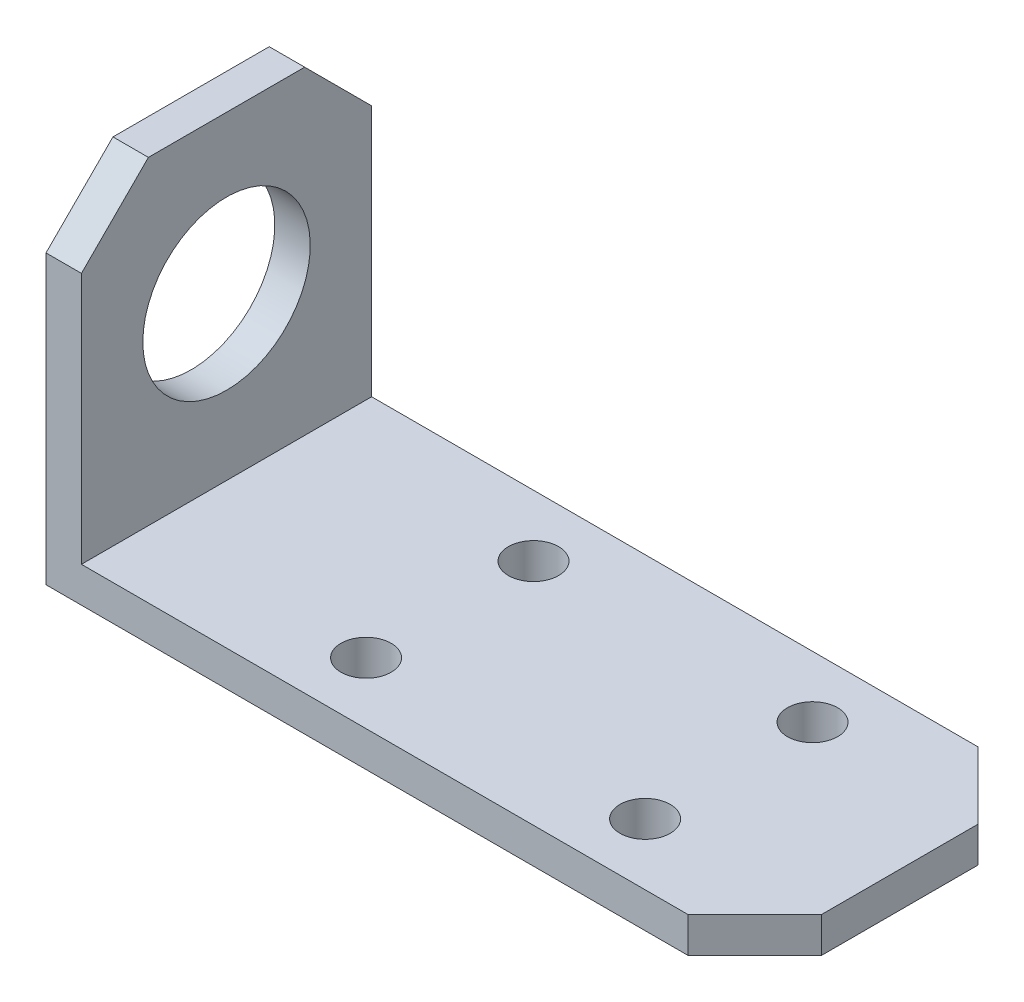
ISO-10303-21;
HEADER;
FILE_DESCRIPTION(('STEP AP214'),'2;1');
FILE_NAME('part.step','',(''),(''),'','','');
FILE_SCHEMA(('AUTOMOTIVE_DESIGN { 1 0 10303 214 1 1 1 1 }'));
ENDSEC;
DATA;
#1=APPLICATION_CONTEXT('core data for automotive mechanical design processes');
#2=APPLICATION_PROTOCOL_DEFINITION('international standard','automotive_design',2000,#1);
#3=PRODUCT_CONTEXT('',#1,'mechanical');
#4=PRODUCT('Part','Part','',(#3));
#5=PRODUCT_RELATED_PRODUCT_CATEGORY('part','',(#4));
#6=PRODUCT_DEFINITION_FORMATION('','',#4);
#7=PRODUCT_DEFINITION_CONTEXT('part definition',#1,'design');
#8=PRODUCT_DEFINITION('design','',#6,#7);
#9=PRODUCT_DEFINITION_SHAPE('','',#8);
#10=(LENGTH_UNIT() NAMED_UNIT(*) SI_UNIT(.MILLI.,.METRE.));
#11=(NAMED_UNIT(*) PLANE_ANGLE_UNIT() SI_UNIT($,.RADIAN.));
#12=(NAMED_UNIT(*) SI_UNIT($,.STERADIAN.) SOLID_ANGLE_UNIT());
#13=UNCERTAINTY_MEASURE_WITH_UNIT(LENGTH_MEASURE(1.E-05),#10,'distance_accuracy_value','');
#14=(GEOMETRIC_REPRESENTATION_CONTEXT(3) GLOBAL_UNCERTAINTY_ASSIGNED_CONTEXT((#13)) GLOBAL_UNIT_ASSIGNED_CONTEXT((#10,
#11,#12)) REPRESENTATION_CONTEXT('',''));
#15=CARTESIAN_POINT('',(0.,0.,0.));
#16=DIRECTION('',(0.,0.,1.));
#17=DIRECTION('',(1.,0.,0.));
#18=AXIS2_PLACEMENT_3D('',#15,#16,#17);
#19=CARTESIAN_POINT('',(63.5,0.,26.));
#20=DIRECTION('',(0.,1.,0.));
#21=DIRECTION('',(-1.,0.,0.));
#22=AXIS2_PLACEMENT_3D('',#19,#20,#21);
#23=PLANE('',#22);
#24=CARTESIAN_POINT('',(23.175,0.,20.5));
#25=DIRECTION('',(0.,1.,0.));
#26=DIRECTION('',(0.,0.,1.));
#27=AXIS2_PLACEMENT_3D('',#24,#25,#26);
#28=CIRCLE('',#27,2.24999999999999);
#29=CARTESIAN_POINT('',(23.175,0.,22.75));
#30=VERTEX_POINT('',#29);
#31=EDGE_CURVE('E268',#30,#30,#28,.T.);
#32=ORIENTED_EDGE('',*,*,#31,.T.);
#33=EDGE_LOOP('',(#32));
#34=FACE_BOUND('',#33,.T.);
#35=CARTESIAN_POINT('',(23.175,0.,5.5));
#36=DIRECTION('',(0.,1.,0.));
#37=DIRECTION('',(0.,0.,1.));
#38=AXIS2_PLACEMENT_3D('',#35,#36,#37);
#39=CIRCLE('',#38,2.24999999999999);
#40=CARTESIAN_POINT('',(23.175,0.,7.74999999999999));
#41=VERTEX_POINT('',#40);
#42=EDGE_CURVE('E260',#41,#41,#39,.T.);
#43=ORIENTED_EDGE('',*,*,#42,.T.);
#44=EDGE_LOOP('',(#43));
#45=FACE_BOUND('',#44,.T.);
#46=CARTESIAN_POINT('',(48.175,0.,5.5));
#47=DIRECTION('',(0.,1.,0.));
#48=DIRECTION('',(0.,0.,1.));
#49=AXIS2_PLACEMENT_3D('',#46,#47,#48);
#50=CIRCLE('',#49,2.24999999999999);
#51=CARTESIAN_POINT('',(48.175,0.,7.74999999999999));
#52=VERTEX_POINT('',#51);
#53=EDGE_CURVE('E252',#52,#52,#50,.T.);
#54=ORIENTED_EDGE('',*,*,#53,.T.);
#55=EDGE_LOOP('',(#54));
#56=FACE_BOUND('',#55,.T.);
#57=CARTESIAN_POINT('',(48.175,0.,20.5));
#58=DIRECTION('',(0.,1.,0.));
#59=DIRECTION('',(0.,0.,1.));
#60=AXIS2_PLACEMENT_3D('',#57,#58,#59);
#61=CIRCLE('',#60,2.24999999999999);
#62=CARTESIAN_POINT('',(48.175,0.,22.75));
#63=VERTEX_POINT('',#62);
#64=EDGE_CURVE('E168',#63,#63,#61,.T.);
#65=ORIENTED_EDGE('',*,*,#64,.T.);
#66=EDGE_LOOP('',(#65));
#67=FACE_BOUND('',#66,.T.);
#68=DIRECTION('',(0.,0.,-1.));
#69=VECTOR('',#68,1.);
#70=CARTESIAN_POINT('',(63.5,0.,26.));
#71=LINE('',#70,#69);
#72=CARTESIAN_POINT('',(63.5,0.,20.));
#73=VERTEX_POINT('',#72);
#74=CARTESIAN_POINT('',(63.5,0.,6.00000000000001));
#75=VERTEX_POINT('',#74);
#76=EDGE_CURVE('E190',#73,#75,#71,.T.);
#77=ORIENTED_EDGE('',*,*,#76,.F.);
#78=DIRECTION('',(0.707106781186545,0.,-0.70710678118655));
#79=VECTOR('',#78,1.);
#80=CARTESIAN_POINT('',(57.5,0.,26.));
#81=LINE('',#80,#79);
#82=CARTESIAN_POINT('',(57.5,0.,26.));
#83=VERTEX_POINT('',#82);
#84=EDGE_CURVE('E11',#73,#83,#81,.F.);
#85=ORIENTED_EDGE('',*,*,#84,.T.);
#86=DIRECTION('',(1.,0.,0.));
#87=VECTOR('',#86,1.);
#88=CARTESIAN_POINT('',(63.5,0.,26.));
#89=LINE('',#88,#87);
#90=CARTESIAN_POINT('',(0.,0.,26.));
#91=VERTEX_POINT('',#90);
#92=EDGE_CURVE('E139',#91,#83,#89,.T.);
#93=ORIENTED_EDGE('',*,*,#92,.F.);
#94=DIRECTION('',(0.,0.,-1.));
#95=VECTOR('',#94,1.);
#96=CARTESIAN_POINT('',(0.,0.,26.));
#97=LINE('',#96,#95);
#98=CARTESIAN_POINT('',(0.,0.,0.));
#99=VERTEX_POINT('',#98);
#100=EDGE_CURVE('E161',#91,#99,#97,.T.);
#101=ORIENTED_EDGE('',*,*,#100,.T.);
#102=DIRECTION('',(1.,0.,0.));
#103=VECTOR('',#102,1.);
#104=CARTESIAN_POINT('',(63.5,0.,0.));
#105=LINE('',#104,#103);
#106=CARTESIAN_POINT('',(57.5,0.,0.));
#107=VERTEX_POINT('',#106);
#108=EDGE_CURVE('E165',#99,#107,#105,.T.);
#109=ORIENTED_EDGE('',*,*,#108,.T.);
#110=DIRECTION('',(0.707106781186549,0.,0.707106781186546));
#111=VECTOR('',#110,1.);
#112=CARTESIAN_POINT('',(63.5,0.,6.));
#113=LINE('',#112,#111);
#114=EDGE_CURVE('E57',#107,#75,#113,.T.);
#115=ORIENTED_EDGE('',*,*,#114,.T.);
#116=EDGE_LOOP('',(#77,#85,#93,#101,#109,#115));
#117=FACE_BOUND('',#116,.T.);
#118=ADVANCED_FACE('F47',(#34,#45,#56,#67,#117),#23,.F.);
#119=CARTESIAN_POINT('',(63.5,3.175,26.));
#120=DIRECTION('',(-1.,0.,0.));
#121=DIRECTION('',(0.,0.,1.));
#122=AXIS2_PLACEMENT_3D('',#119,#120,#121);
#123=PLANE('',#122);
#124=DIRECTION('',(0.,0.,-1.));
#125=VECTOR('',#124,1.);
#126=CARTESIAN_POINT('',(63.5,3.175,26.));
#127=LINE('',#126,#125);
#128=CARTESIAN_POINT('',(63.5,3.175,20.));
#129=VERTEX_POINT('',#128);
#130=CARTESIAN_POINT('',(63.5,3.175,6.00000000000001));
#131=VERTEX_POINT('',#130);
#132=EDGE_CURVE('E150',#129,#131,#127,.T.);
#133=ORIENTED_EDGE('',*,*,#132,.F.);
#134=DIRECTION('',(0.,-1.,0.));
#135=VECTOR('',#134,1.);
#136=CARTESIAN_POINT('',(63.5,3.175,20.));
#137=LINE('',#136,#135);
#138=EDGE_CURVE('E70',#129,#73,#137,.T.);
#139=ORIENTED_EDGE('',*,*,#138,.T.);
#140=ORIENTED_EDGE('',*,*,#76,.T.);
#141=DIRECTION('',(0.,1.,0.));
#142=VECTOR('',#141,1.);
#143=CARTESIAN_POINT('',(63.5,3.175,6.));
#144=LINE('',#143,#142);
#145=EDGE_CURVE('E228',#75,#131,#144,.T.);
#146=ORIENTED_EDGE('',*,*,#145,.T.);
#147=EDGE_LOOP('',(#133,#139,#140,#146));
#148=FACE_BOUND('',#147,.T.);
#149=ADVANCED_FACE('F235',(#148),#123,.F.);
#150=CARTESIAN_POINT('',(3.175,3.175,26.));
#151=DIRECTION('',(0.,-1.,0.));
#152=DIRECTION('',(1.,0.,0.));
#153=AXIS2_PLACEMENT_3D('',#150,#151,#152);
#154=PLANE('',#153);
#155=CARTESIAN_POINT('',(23.175,3.175,20.5));
#156=DIRECTION('',(0.,1.,0.));
#157=DIRECTION('',(0.,0.,1.));
#158=AXIS2_PLACEMENT_3D('',#155,#156,#157);
#159=CIRCLE('',#158,2.24999999999999);
#160=CARTESIAN_POINT('',(23.175,3.175,22.75));
#161=VERTEX_POINT('',#160);
#162=EDGE_CURVE('E272',#161,#161,#159,.T.);
#163=ORIENTED_EDGE('',*,*,#162,.F.);
#164=EDGE_LOOP('',(#163));
#165=FACE_BOUND('',#164,.T.);
#166=CARTESIAN_POINT('',(23.175,3.175,5.5));
#167=DIRECTION('',(0.,1.,0.));
#168=DIRECTION('',(0.,0.,1.));
#169=AXIS2_PLACEMENT_3D('',#166,#167,#168);
#170=CIRCLE('',#169,2.24999999999999);
#171=CARTESIAN_POINT('',(23.175,3.175,7.74999999999999));
#172=VERTEX_POINT('',#171);
#173=EDGE_CURVE('E264',#172,#172,#170,.T.);
#174=ORIENTED_EDGE('',*,*,#173,.F.);
#175=EDGE_LOOP('',(#174));
#176=FACE_BOUND('',#175,.T.);
#177=CARTESIAN_POINT('',(48.175,3.175,5.5));
#178=DIRECTION('',(0.,1.,0.));
#179=DIRECTION('',(0.,0.,1.));
#180=AXIS2_PLACEMENT_3D('',#177,#178,#179);
#181=CIRCLE('',#180,2.24999999999999);
#182=CARTESIAN_POINT('',(48.175,3.175,7.74999999999999));
#183=VERTEX_POINT('',#182);
#184=EDGE_CURVE('E256',#183,#183,#181,.T.);
#185=ORIENTED_EDGE('',*,*,#184,.F.);
#186=EDGE_LOOP('',(#185));
#187=FACE_BOUND('',#186,.T.);
#188=CARTESIAN_POINT('',(48.175,3.175,20.5));
#189=DIRECTION('',(0.,1.,0.));
#190=DIRECTION('',(0.,0.,1.));
#191=AXIS2_PLACEMENT_3D('',#188,#189,#190);
#192=CIRCLE('',#191,2.24999999999999);
#193=CARTESIAN_POINT('',(48.175,3.175,22.75));
#194=VERTEX_POINT('',#193);
#195=EDGE_CURVE('E248',#194,#194,#192,.T.);
#196=ORIENTED_EDGE('',*,*,#195,.F.);
#197=EDGE_LOOP('',(#196));
#198=FACE_BOUND('',#197,.T.);
#199=DIRECTION('',(-1.,0.,0.));
#200=VECTOR('',#199,1.);
#201=CARTESIAN_POINT('',(3.175,3.175,26.));
#202=LINE('',#201,#200);
#203=CARTESIAN_POINT('',(57.5,3.175,26.));
#204=VERTEX_POINT('',#203);
#205=CARTESIAN_POINT('',(3.175,3.175,26.));
#206=VERTEX_POINT('',#205);
#207=EDGE_CURVE('E127',#204,#206,#202,.T.);
#208=ORIENTED_EDGE('',*,*,#207,.F.);
#209=DIRECTION('',(-0.707106781186545,0.,0.70710678118655));
#210=VECTOR('',#209,1.);
#211=CARTESIAN_POINT('',(57.5,3.175,26.));
#212=LINE('',#211,#210);
#213=EDGE_CURVE('E225',#204,#129,#212,.F.);
#214=ORIENTED_EDGE('',*,*,#213,.T.);
#215=ORIENTED_EDGE('',*,*,#132,.T.);
#216=DIRECTION('',(-0.707106781186549,0.,-0.707106781186546));
#217=VECTOR('',#216,1.);
#218=CARTESIAN_POINT('',(63.5,3.175,6.));
#219=LINE('',#218,#217);
#220=CARTESIAN_POINT('',(57.5,3.175,0.));
#221=VERTEX_POINT('',#220);
#222=EDGE_CURVE('E222',#131,#221,#219,.T.);
#223=ORIENTED_EDGE('',*,*,#222,.T.);
#224=DIRECTION('',(-1.,0.,0.));
#225=VECTOR('',#224,1.);
#226=CARTESIAN_POINT('',(3.175,3.175,0.));
#227=LINE('',#226,#225);
#228=CARTESIAN_POINT('',(3.175,3.175,0.));
#229=VERTEX_POINT('',#228);
#230=EDGE_CURVE('E145',#221,#229,#227,.T.);
#231=ORIENTED_EDGE('',*,*,#230,.T.);
#232=DIRECTION('',(0.,0.,-1.));
#233=VECTOR('',#232,1.);
#234=CARTESIAN_POINT('',(3.175,3.175,26.));
#235=LINE('',#234,#233);
#236=EDGE_CURVE('E142',#206,#229,#235,.T.);
#237=ORIENTED_EDGE('',*,*,#236,.F.);
#238=EDGE_LOOP('',(#208,#214,#215,#223,#231,#237));
#239=FACE_BOUND('',#238,.T.);
#240=ADVANCED_FACE('F143',(#165,#176,#187,#198,#239),#154,.F.);
#241=CARTESIAN_POINT('',(3.175,31.75,26.));
#242=DIRECTION('',(-1.,0.,0.));
#243=DIRECTION('',(0.,-1.,0.));
#244=AXIS2_PLACEMENT_3D('',#241,#242,#243);
#245=PLANE('',#244);
#246=CARTESIAN_POINT('',(3.175,17.675,13.));
#247=DIRECTION('',(-1.,0.,0.));
#248=DIRECTION('',(0.,-1.,0.));
#249=AXIS2_PLACEMENT_3D('',#246,#247,#248);
#250=CIRCLE('',#249,7.5);
#251=CARTESIAN_POINT('',(3.175,10.175,13.));
#252=VERTEX_POINT('',#251);
#253=EDGE_CURVE('E276',#252,#252,#250,.T.);
#254=ORIENTED_EDGE('',*,*,#253,.T.);
#255=EDGE_LOOP('',(#254));
#256=FACE_BOUND('',#255,.T.);
#257=DIRECTION('',(0.,1.,0.));
#258=VECTOR('',#257,1.);
#259=CARTESIAN_POINT('',(3.175,31.75,0.));
#260=LINE('',#259,#258);
#261=CARTESIAN_POINT('',(3.175,25.75,0.));
#262=VERTEX_POINT('',#261);
#263=EDGE_CURVE('E171',#229,#262,#260,.T.);
#264=ORIENTED_EDGE('',*,*,#263,.T.);
#265=DIRECTION('',(0.,0.707106781186549,0.707106781186546));
#266=VECTOR('',#265,1.);
#267=CARTESIAN_POINT('',(3.175,31.75,6.));
#268=LINE('',#267,#266);
#269=CARTESIAN_POINT('',(3.175,31.75,6.00000000000001));
#270=VERTEX_POINT('',#269);
#271=EDGE_CURVE('E214',#262,#270,#268,.T.);
#272=ORIENTED_EDGE('',*,*,#271,.T.);
#273=DIRECTION('',(0.,0.,-1.));
#274=VECTOR('',#273,1.);
#275=CARTESIAN_POINT('',(3.175,31.75,26.));
#276=LINE('',#275,#274);
#277=CARTESIAN_POINT('',(3.175,31.75,20.));
#278=VERTEX_POINT('',#277);
#279=EDGE_CURVE('E151',#278,#270,#276,.T.);
#280=ORIENTED_EDGE('',*,*,#279,.F.);
#281=DIRECTION('',(0.,0.707106781186546,-0.707106781186549));
#282=VECTOR('',#281,1.);
#283=CARTESIAN_POINT('',(3.175,25.75,26.));
#284=LINE('',#283,#282);
#285=CARTESIAN_POINT('',(3.175,25.75,26.));
#286=VERTEX_POINT('',#285);
#287=EDGE_CURVE('E156',#278,#286,#284,.F.);
#288=ORIENTED_EDGE('',*,*,#287,.T.);
#289=DIRECTION('',(0.,1.,0.));
#290=VECTOR('',#289,1.);
#291=CARTESIAN_POINT('',(3.175,31.75,26.));
#292=LINE('',#291,#290);
#293=EDGE_CURVE('E132',#206,#286,#292,.T.);
#294=ORIENTED_EDGE('',*,*,#293,.F.);
#295=ORIENTED_EDGE('',*,*,#236,.T.);
#296=EDGE_LOOP('',(#264,#272,#280,#288,#294,#295));
#297=FACE_BOUND('',#296,.T.);
#298=ADVANCED_FACE('F153',(#256,#297),#245,.F.);
#299=CARTESIAN_POINT('',(0.,31.75,26.));
#300=DIRECTION('',(0.,-1.,0.));
#301=DIRECTION('',(0.,0.,-1.));
#302=AXIS2_PLACEMENT_3D('',#299,#300,#301);
#303=PLANE('',#302);
#304=ORIENTED_EDGE('',*,*,#279,.T.);
#305=DIRECTION('',(-1.,0.,0.));
#306=VECTOR('',#305,1.);
#307=CARTESIAN_POINT('',(0.,31.75,6.));
#308=LINE('',#307,#306);
#309=CARTESIAN_POINT('',(0.,31.75,6.00000000000001));
#310=VERTEX_POINT('',#309);
#311=EDGE_CURVE('E196',#270,#310,#308,.T.);
#312=ORIENTED_EDGE('',*,*,#311,.T.);
#313=DIRECTION('',(0.,0.,-1.));
#314=VECTOR('',#313,1.);
#315=CARTESIAN_POINT('',(0.,31.75,26.));
#316=LINE('',#315,#314);
#317=CARTESIAN_POINT('',(0.,31.75,20.));
#318=VERTEX_POINT('',#317);
#319=EDGE_CURVE('E180',#318,#310,#316,.T.);
#320=ORIENTED_EDGE('',*,*,#319,.F.);
#321=DIRECTION('',(1.,0.,0.));
#322=VECTOR('',#321,1.);
#323=CARTESIAN_POINT('',(0.,31.75,20.));
#324=LINE('',#323,#322);
#325=EDGE_CURVE('E193',#318,#278,#324,.T.);
#326=ORIENTED_EDGE('',*,*,#325,.T.);
#327=EDGE_LOOP('',(#304,#312,#320,#326));
#328=FACE_BOUND('',#327,.T.);
#329=ADVANCED_FACE('F291',(#328),#303,.F.);
#330=CARTESIAN_POINT('',(0.,0.,26.));
#331=DIRECTION('',(1.,0.,0.));
#332=DIRECTION('',(0.,0.,-1.));
#333=AXIS2_PLACEMENT_3D('',#330,#331,#332);
#334=PLANE('',#333);
#335=CARTESIAN_POINT('',(0.,17.675,13.));
#336=DIRECTION('',(-1.,0.,0.));
#337=DIRECTION('',(0.,0.,1.));
#338=AXIS2_PLACEMENT_3D('',#335,#336,#337);
#339=CIRCLE('',#338,7.5);
#340=CARTESIAN_POINT('',(0.,17.675,20.5));
#341=VERTEX_POINT('',#340);
#342=EDGE_CURVE('E280',#341,#341,#339,.T.);
#343=ORIENTED_EDGE('',*,*,#342,.F.);
#344=EDGE_LOOP('',(#343));
#345=FACE_BOUND('',#344,.T.);
#346=ORIENTED_EDGE('',*,*,#319,.T.);
#347=DIRECTION('',(0.,-0.707106781186549,-0.707106781186546));
#348=VECTOR('',#347,1.);
#349=CARTESIAN_POINT('',(0.,31.75,6.));
#350=LINE('',#349,#348);
#351=CARTESIAN_POINT('',(0.,25.75,0.));
#352=VERTEX_POINT('',#351);
#353=EDGE_CURVE('E203',#310,#352,#350,.T.);
#354=ORIENTED_EDGE('',*,*,#353,.T.);
#355=DIRECTION('',(0.,-1.,0.));
#356=VECTOR('',#355,1.);
#357=CARTESIAN_POINT('',(0.,0.,0.));
#358=LINE('',#357,#356);
#359=EDGE_CURVE('E174',#352,#99,#358,.T.);
#360=ORIENTED_EDGE('',*,*,#359,.T.);
#361=ORIENTED_EDGE('',*,*,#100,.F.);
#362=DIRECTION('',(0.,-1.,0.));
#363=VECTOR('',#362,1.);
#364=CARTESIAN_POINT('',(0.,0.,26.));
#365=LINE('',#364,#363);
#366=CARTESIAN_POINT('',(0.,25.75,26.));
#367=VERTEX_POINT('',#366);
#368=EDGE_CURVE('E158',#367,#91,#365,.T.);
#369=ORIENTED_EDGE('',*,*,#368,.F.);
#370=DIRECTION('',(0.,-0.707106781186546,0.707106781186549));
#371=VECTOR('',#370,1.);
#372=CARTESIAN_POINT('',(0.,25.75,26.));
#373=LINE('',#372,#371);
#374=EDGE_CURVE('E200',#367,#318,#373,.F.);
#375=ORIENTED_EDGE('',*,*,#374,.T.);
#376=EDGE_LOOP('',(#346,#354,#360,#361,#369,#375));
#377=FACE_BOUND('',#376,.T.);
#378=ADVANCED_FACE('F288',(#345,#377),#334,.F.);
#379=CARTESIAN_POINT('',(0.,0.,26.));
#380=DIRECTION('',(0.,0.,-1.));
#381=DIRECTION('',(-1.,0.,0.));
#382=AXIS2_PLACEMENT_3D('',#379,#380,#381);
#383=PLANE('',#382);
#384=ORIENTED_EDGE('',*,*,#293,.T.);
#385=DIRECTION('',(-1.,0.,0.));
#386=VECTOR('',#385,1.);
#387=CARTESIAN_POINT('',(0.,25.75,26.));
#388=LINE('',#387,#386);
#389=EDGE_CURVE('E219',#286,#367,#388,.T.);
#390=ORIENTED_EDGE('',*,*,#389,.T.);
#391=ORIENTED_EDGE('',*,*,#368,.T.);
#392=ORIENTED_EDGE('',*,*,#92,.T.);
#393=DIRECTION('',(0.,1.,0.));
#394=VECTOR('',#393,1.);
#395=CARTESIAN_POINT('',(57.5,0.,26.));
#396=LINE('',#395,#394);
#397=EDGE_CURVE('E136',#83,#204,#396,.T.);
#398=ORIENTED_EDGE('',*,*,#397,.T.);
#399=ORIENTED_EDGE('',*,*,#207,.T.);
#400=EDGE_LOOP('',(#384,#390,#391,#392,#398,#399));
#401=FACE_BOUND('',#400,.T.);
#402=ADVANCED_FACE('F129',(#401),#383,.F.);
#403=CARTESIAN_POINT('',(0.,0.,0.));
#404=DIRECTION('',(0.,0.,-1.));
#405=DIRECTION('',(-1.,0.,0.));
#406=AXIS2_PLACEMENT_3D('',#403,#404,#405);
#407=PLANE('',#406);
#408=ORIENTED_EDGE('',*,*,#359,.F.);
#409=DIRECTION('',(1.,0.,0.));
#410=VECTOR('',#409,1.);
#411=CARTESIAN_POINT('',(3.175,25.75,0.));
#412=LINE('',#411,#410);
#413=EDGE_CURVE('E209',#352,#262,#412,.T.);
#414=ORIENTED_EDGE('',*,*,#413,.T.);
#415=ORIENTED_EDGE('',*,*,#263,.F.);
#416=ORIENTED_EDGE('',*,*,#230,.F.);
#417=DIRECTION('',(0.,-1.,0.));
#418=VECTOR('',#417,1.);
#419=CARTESIAN_POINT('',(57.5,0.,0.));
#420=LINE('',#419,#418);
#421=EDGE_CURVE('E206',#221,#107,#420,.T.);
#422=ORIENTED_EDGE('',*,*,#421,.T.);
#423=ORIENTED_EDGE('',*,*,#108,.F.);
#424=EDGE_LOOP('',(#408,#414,#415,#416,#422,#423));
#425=FACE_BOUND('',#424,.T.);
#426=ADVANCED_FACE('F302',(#425),#407,.T.);
#427=CARTESIAN_POINT('',(48.175,3.175,20.5));
#428=DIRECTION('',(0.,1.,0.));
#429=DIRECTION('',(0.,0.,1.));
#430=AXIS2_PLACEMENT_3D('',#427,#428,#429);
#431=CYLINDRICAL_SURFACE('',#430,2.24999999999999);
#432=ORIENTED_EDGE('',*,*,#64,.F.);
#433=EDGE_LOOP('',(#432));
#434=FACE_BOUND('',#433,.T.);
#435=ORIENTED_EDGE('',*,*,#195,.T.);
#436=EDGE_LOOP('',(#435));
#437=FACE_BOUND('',#436,.T.);
#438=ADVANCED_FACE('F389',(#434,#437),#431,.F.);
#439=CARTESIAN_POINT('',(48.175,3.175,5.5));
#440=DIRECTION('',(0.,1.,0.));
#441=DIRECTION('',(0.,0.,1.));
#442=AXIS2_PLACEMENT_3D('',#439,#440,#441);
#443=CYLINDRICAL_SURFACE('',#442,2.24999999999999);
#444=ORIENTED_EDGE('',*,*,#53,.F.);
#445=EDGE_LOOP('',(#444));
#446=FACE_BOUND('',#445,.T.);
#447=ORIENTED_EDGE('',*,*,#184,.T.);
#448=EDGE_LOOP('',(#447));
#449=FACE_BOUND('',#448,.T.);
#450=ADVANCED_FACE('F380',(#446,#449),#443,.F.);
#451=CARTESIAN_POINT('',(23.175,3.175,5.5));
#452=DIRECTION('',(0.,1.,0.));
#453=DIRECTION('',(0.,0.,1.));
#454=AXIS2_PLACEMENT_3D('',#451,#452,#453);
#455=CYLINDRICAL_SURFACE('',#454,2.24999999999999);
#456=ORIENTED_EDGE('',*,*,#42,.F.);
#457=EDGE_LOOP('',(#456));
#458=FACE_BOUND('',#457,.T.);
#459=ORIENTED_EDGE('',*,*,#173,.T.);
#460=EDGE_LOOP('',(#459));
#461=FACE_BOUND('',#460,.T.);
#462=ADVANCED_FACE('F371',(#458,#461),#455,.F.);
#463=CARTESIAN_POINT('',(23.175,3.175,20.5));
#464=DIRECTION('',(0.,1.,0.));
#465=DIRECTION('',(0.,0.,1.));
#466=AXIS2_PLACEMENT_3D('',#463,#464,#465);
#467=CYLINDRICAL_SURFACE('',#466,2.24999999999999);
#468=ORIENTED_EDGE('',*,*,#31,.F.);
#469=EDGE_LOOP('',(#468));
#470=FACE_BOUND('',#469,.T.);
#471=ORIENTED_EDGE('',*,*,#162,.T.);
#472=EDGE_LOOP('',(#471));
#473=FACE_BOUND('',#472,.T.);
#474=ADVANCED_FACE('F363',(#470,#473),#467,.F.);
#475=CARTESIAN_POINT('',(63.5,17.675,13.));
#476=DIRECTION('',(-1.,0.,0.));
#477=DIRECTION('',(0.,0.,1.));
#478=AXIS2_PLACEMENT_3D('',#475,#476,#477);
#479=CYLINDRICAL_SURFACE('',#478,7.5);
#480=ORIENTED_EDGE('',*,*,#342,.T.);
#481=EDGE_LOOP('',(#480));
#482=FACE_BOUND('',#481,.T.);
#483=ORIENTED_EDGE('',*,*,#253,.F.);
#484=EDGE_LOOP('',(#483));
#485=FACE_BOUND('',#484,.T.);
#486=ADVANCED_FACE('F285',(#482,#485),#479,.F.);
#487=CARTESIAN_POINT('',(0.,31.75,6.));
#488=DIRECTION('',(0.,0.707106781186546,-0.707106781186549));
#489=DIRECTION('',(1.,0.,0.));
#490=AXIS2_PLACEMENT_3D('',#487,#488,#489);
#491=PLANE('',#490);
#492=ORIENTED_EDGE('',*,*,#271,.F.);
#493=ORIENTED_EDGE('',*,*,#413,.F.);
#494=ORIENTED_EDGE('',*,*,#353,.F.);
#495=ORIENTED_EDGE('',*,*,#311,.F.);
#496=EDGE_LOOP('',(#492,#493,#494,#495));
#497=FACE_BOUND('',#496,.T.);
#498=ADVANCED_FACE('F321',(#497),#491,.T.);
#499=CARTESIAN_POINT('',(0.,25.75,26.));
#500=DIRECTION('',(0.,-0.707106781186549,-0.707106781186546));
#501=DIRECTION('',(-1.,0.,0.));
#502=AXIS2_PLACEMENT_3D('',#499,#500,#501);
#503=PLANE('',#502);
#504=ORIENTED_EDGE('',*,*,#287,.F.);
#505=ORIENTED_EDGE('',*,*,#325,.F.);
#506=ORIENTED_EDGE('',*,*,#374,.F.);
#507=ORIENTED_EDGE('',*,*,#389,.F.);
#508=EDGE_LOOP('',(#504,#505,#506,#507));
#509=FACE_BOUND('',#508,.T.);
#510=ADVANCED_FACE('F299',(#509),#503,.F.);
#511=CARTESIAN_POINT('',(57.5,0.,26.));
#512=DIRECTION('',(-0.70710678118655,0.,-0.707106781186545));
#513=DIRECTION('',(0.,1.,0.));
#514=AXIS2_PLACEMENT_3D('',#511,#512,#513);
#515=PLANE('',#514);
#516=ORIENTED_EDGE('',*,*,#84,.F.);
#517=ORIENTED_EDGE('',*,*,#138,.F.);
#518=ORIENTED_EDGE('',*,*,#213,.F.);
#519=ORIENTED_EDGE('',*,*,#397,.F.);
#520=EDGE_LOOP('',(#516,#517,#518,#519));
#521=FACE_BOUND('',#520,.T.);
#522=ADVANCED_FACE('F239',(#521),#515,.F.);
#523=CARTESIAN_POINT('',(63.5,3.175,6.));
#524=DIRECTION('',(0.707106781186546,0.,-0.707106781186549));
#525=DIRECTION('',(0.,-1.,0.));
#526=AXIS2_PLACEMENT_3D('',#523,#524,#525);
#527=PLANE('',#526);
#528=ORIENTED_EDGE('',*,*,#114,.F.);
#529=ORIENTED_EDGE('',*,*,#421,.F.);
#530=ORIENTED_EDGE('',*,*,#222,.F.);
#531=ORIENTED_EDGE('',*,*,#145,.F.);
#532=EDGE_LOOP('',(#528,#529,#530,#531));
#533=FACE_BOUND('',#532,.T.);
#534=ADVANCED_FACE('F50',(#533),#527,.T.);
#535=CLOSED_SHELL('',(#118,#149,#240,#298,#329,#378,#402,#426,#438,#450,#462,#474,#486,#498,
#510,#522,#534));
#536=MANIFOLD_SOLID_BREP('B2',#535);
#537=ADVANCED_BREP_SHAPE_REPRESENTATION('',(#18,#536),#14);
#538=SHAPE_DEFINITION_REPRESENTATION(#9,#537);
ENDSEC;
END-ISO-10303-21;
